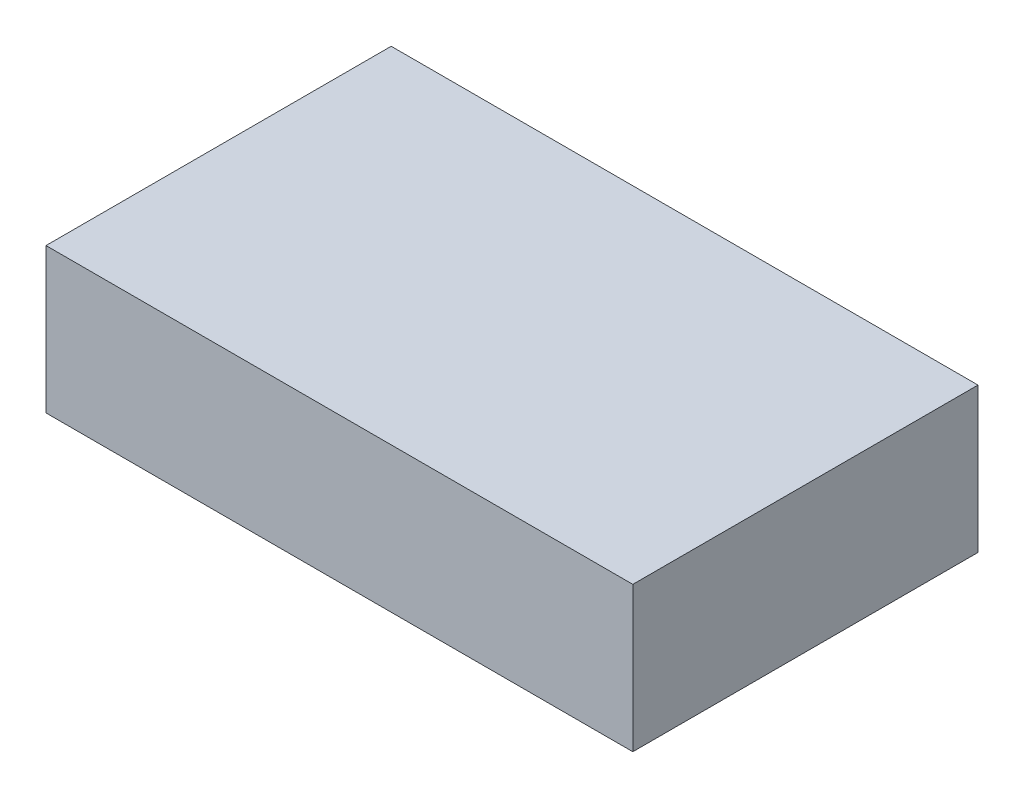
ISO-10303-21;
HEADER;
FILE_DESCRIPTION(('STEP AP214'),'2;1');
FILE_NAME('part.step','',(''),(''),'','','');
FILE_SCHEMA(('AUTOMOTIVE_DESIGN { 1 0 10303 214 1 1 1 1 }'));
ENDSEC;
DATA;
#1=APPLICATION_CONTEXT('core data for automotive mechanical design processes');
#2=APPLICATION_PROTOCOL_DEFINITION('international standard','automotive_design',2000,#1);
#3=PRODUCT_CONTEXT('',#1,'mechanical');
#4=PRODUCT('Part','Part','',(#3));
#5=PRODUCT_RELATED_PRODUCT_CATEGORY('part','',(#4));
#6=PRODUCT_DEFINITION_FORMATION('','',#4);
#7=PRODUCT_DEFINITION_CONTEXT('part definition',#1,'design');
#8=PRODUCT_DEFINITION('design','',#6,#7);
#9=PRODUCT_DEFINITION_SHAPE('','',#8);
#10=(LENGTH_UNIT() NAMED_UNIT(*) SI_UNIT(.MILLI.,.METRE.));
#11=(NAMED_UNIT(*) PLANE_ANGLE_UNIT() SI_UNIT($,.RADIAN.));
#12=(NAMED_UNIT(*) SI_UNIT($,.STERADIAN.) SOLID_ANGLE_UNIT());
#13=UNCERTAINTY_MEASURE_WITH_UNIT(LENGTH_MEASURE(1.E-05),#10,'distance_accuracy_value','');
#14=(GEOMETRIC_REPRESENTATION_CONTEXT(3) GLOBAL_UNCERTAINTY_ASSIGNED_CONTEXT((#13)) GLOBAL_UNIT_ASSIGNED_CONTEXT((#10,
#11,#12)) REPRESENTATION_CONTEXT('',''));
#15=CARTESIAN_POINT('',(0.,0.,0.));
#16=DIRECTION('',(0.,0.,1.));
#17=DIRECTION('',(1.,0.,0.));
#18=AXIS2_PLACEMENT_3D('',#15,#16,#17);
#19=CARTESIAN_POINT('',(42.5,10.5,25.));
#20=DIRECTION('',(-1.,0.,0.));
#21=DIRECTION('',(0.,0.,1.));
#22=AXIS2_PLACEMENT_3D('',#19,#20,#21);
#23=PLANE('',#22);
#24=DIRECTION('',(0.,0.,-1.));
#25=VECTOR('',#24,1.);
#26=CARTESIAN_POINT('',(42.5,-10.5,25.));
#27=LINE('',#26,#25);
#28=CARTESIAN_POINT('',(42.5,-10.5,25.));
#29=VERTEX_POINT('',#28);
#30=CARTESIAN_POINT('',(42.5,-10.5,-25.));
#31=VERTEX_POINT('',#30);
#32=EDGE_CURVE('E111',#29,#31,#27,.T.);
#33=ORIENTED_EDGE('',*,*,#32,.T.);
#34=DIRECTION('',(0.,-1.,0.));
#35=VECTOR('',#34,1.);
#36=CARTESIAN_POINT('',(42.5,10.5,-25.));
#37=LINE('',#36,#35);
#38=CARTESIAN_POINT('',(42.5,10.5,-25.));
#39=VERTEX_POINT('',#38);
#40=EDGE_CURVE('E11',#39,#31,#37,.T.);
#41=ORIENTED_EDGE('',*,*,#40,.F.);
#42=DIRECTION('',(0.,0.,-1.));
#43=VECTOR('',#42,1.);
#44=CARTESIAN_POINT('',(42.5,10.5,25.));
#45=LINE('',#44,#43);
#46=CARTESIAN_POINT('',(42.5,10.5,25.));
#47=VERTEX_POINT('',#46);
#48=EDGE_CURVE('E95',#47,#39,#45,.T.);
#49=ORIENTED_EDGE('',*,*,#48,.F.);
#50=DIRECTION('',(0.,-1.,0.));
#51=VECTOR('',#50,1.);
#52=CARTESIAN_POINT('',(42.5,10.5,25.));
#53=LINE('',#52,#51);
#54=EDGE_CURVE('E107',#47,#29,#53,.T.);
#55=ORIENTED_EDGE('',*,*,#54,.T.);
#56=EDGE_LOOP('',(#33,#41,#49,#55));
#57=FACE_BOUND('',#56,.T.);
#58=ADVANCED_FACE('F43',(#57),#23,.F.);
#59=CARTESIAN_POINT('',(-42.5,10.5,-25.));
#60=DIRECTION('',(0.,0.,1.));
#61=DIRECTION('',(1.,0.,0.));
#62=AXIS2_PLACEMENT_3D('',#59,#60,#61);
#63=PLANE('',#62);
#64=DIRECTION('',(-1.,0.,0.));
#65=VECTOR('',#64,1.);
#66=CARTESIAN_POINT('',(-42.5,-10.5,-25.));
#67=LINE('',#66,#65);
#68=CARTESIAN_POINT('',(-42.5,-10.5,-25.));
#69=VERTEX_POINT('',#68);
#70=EDGE_CURVE('E100',#31,#69,#67,.T.);
#71=ORIENTED_EDGE('',*,*,#70,.T.);
#72=DIRECTION('',(0.,-1.,0.));
#73=VECTOR('',#72,1.);
#74=CARTESIAN_POINT('',(-42.5,10.5,-25.));
#75=LINE('',#74,#73);
#76=CARTESIAN_POINT('',(-42.5,10.5,-25.));
#77=VERTEX_POINT('',#76);
#78=EDGE_CURVE('E52',#77,#69,#75,.T.);
#79=ORIENTED_EDGE('',*,*,#78,.F.);
#80=DIRECTION('',(-1.,0.,0.));
#81=VECTOR('',#80,1.);
#82=CARTESIAN_POINT('',(-42.5,10.5,-25.));
#83=LINE('',#82,#81);
#84=EDGE_CURVE('E90',#39,#77,#83,.T.);
#85=ORIENTED_EDGE('',*,*,#84,.F.);
#86=ORIENTED_EDGE('',*,*,#40,.T.);
#87=EDGE_LOOP('',(#71,#79,#85,#86));
#88=FACE_BOUND('',#87,.T.);
#89=ADVANCED_FACE('F99',(#88),#63,.F.);
#90=CARTESIAN_POINT('',(-42.5,10.5,25.));
#91=DIRECTION('',(1.,0.,0.));
#92=DIRECTION('',(0.,0.,-1.));
#93=AXIS2_PLACEMENT_3D('',#90,#91,#92);
#94=PLANE('',#93);
#95=DIRECTION('',(0.,0.,1.));
#96=VECTOR('',#95,1.);
#97=CARTESIAN_POINT('',(-42.5,-10.5,25.));
#98=LINE('',#97,#96);
#99=CARTESIAN_POINT('',(-42.5,-10.5,25.));
#100=VERTEX_POINT('',#99);
#101=EDGE_CURVE('E77',#69,#100,#98,.T.);
#102=ORIENTED_EDGE('',*,*,#101,.T.);
#103=DIRECTION('',(0.,-1.,0.));
#104=VECTOR('',#103,1.);
#105=CARTESIAN_POINT('',(-42.5,10.5,25.));
#106=LINE('',#105,#104);
#107=CARTESIAN_POINT('',(-42.5,10.5,25.));
#108=VERTEX_POINT('',#107);
#109=EDGE_CURVE('E102',#108,#100,#106,.T.);
#110=ORIENTED_EDGE('',*,*,#109,.F.);
#111=DIRECTION('',(0.,0.,1.));
#112=VECTOR('',#111,1.);
#113=CARTESIAN_POINT('',(-42.5,10.5,25.));
#114=LINE('',#113,#112);
#115=EDGE_CURVE('E93',#77,#108,#114,.T.);
#116=ORIENTED_EDGE('',*,*,#115,.F.);
#117=ORIENTED_EDGE('',*,*,#78,.T.);
#118=EDGE_LOOP('',(#102,#110,#116,#117));
#119=FACE_BOUND('',#118,.T.);
#120=ADVANCED_FACE('F103',(#119),#94,.F.);
#121=CARTESIAN_POINT('',(-42.5,10.5,25.));
#122=DIRECTION('',(0.,0.,-1.));
#123=DIRECTION('',(-1.,0.,0.));
#124=AXIS2_PLACEMENT_3D('',#121,#122,#123);
#125=PLANE('',#124);
#126=DIRECTION('',(1.,0.,0.));
#127=VECTOR('',#126,1.);
#128=CARTESIAN_POINT('',(-42.5,-10.5,25.));
#129=LINE('',#128,#127);
#130=EDGE_CURVE('E83',#100,#29,#129,.T.);
#131=ORIENTED_EDGE('',*,*,#130,.T.);
#132=ORIENTED_EDGE('',*,*,#54,.F.);
#133=DIRECTION('',(1.,0.,0.));
#134=VECTOR('',#133,1.);
#135=CARTESIAN_POINT('',(-42.5,10.5,25.));
#136=LINE('',#135,#134);
#137=EDGE_CURVE('E60',#108,#47,#136,.T.);
#138=ORIENTED_EDGE('',*,*,#137,.F.);
#139=ORIENTED_EDGE('',*,*,#109,.T.);
#140=EDGE_LOOP('',(#131,#132,#138,#139));
#141=FACE_BOUND('',#140,.T.);
#142=ADVANCED_FACE('F124',(#141),#125,.F.);
#143=CARTESIAN_POINT('',(0.,10.5,0.));
#144=DIRECTION('',(0.,-1.,0.));
#145=DIRECTION('',(0.,0.,-1.));
#146=AXIS2_PLACEMENT_3D('',#143,#144,#145);
#147=PLANE('',#146);
#148=ORIENTED_EDGE('',*,*,#48,.T.);
#149=ORIENTED_EDGE('',*,*,#84,.T.);
#150=ORIENTED_EDGE('',*,*,#115,.T.);
#151=ORIENTED_EDGE('',*,*,#137,.T.);
#152=EDGE_LOOP('',(#148,#149,#150,#151));
#153=FACE_BOUND('',#152,.T.);
#154=ADVANCED_FACE('F91',(#153),#147,.F.);
#155=CARTESIAN_POINT('',(0.,-10.5,0.));
#156=DIRECTION('',(0.,-1.,0.));
#157=DIRECTION('',(0.,0.,-1.));
#158=AXIS2_PLACEMENT_3D('',#155,#156,#157);
#159=PLANE('',#158);
#160=ORIENTED_EDGE('',*,*,#32,.F.);
#161=ORIENTED_EDGE('',*,*,#130,.F.);
#162=ORIENTED_EDGE('',*,*,#101,.F.);
#163=ORIENTED_EDGE('',*,*,#70,.F.);
#164=EDGE_LOOP('',(#160,#161,#162,#163));
#165=FACE_BOUND('',#164,.T.);
#166=ADVANCED_FACE('F127',(#165),#159,.T.);
#167=CLOSED_SHELL('',(#58,#89,#120,#142,#154,#166));
#168=MANIFOLD_SOLID_BREP('B2',#167);
#169=ADVANCED_BREP_SHAPE_REPRESENTATION('',(#18,#168),#14);
#170=SHAPE_DEFINITION_REPRESENTATION(#9,#169);
ENDSEC;
END-ISO-10303-21;
